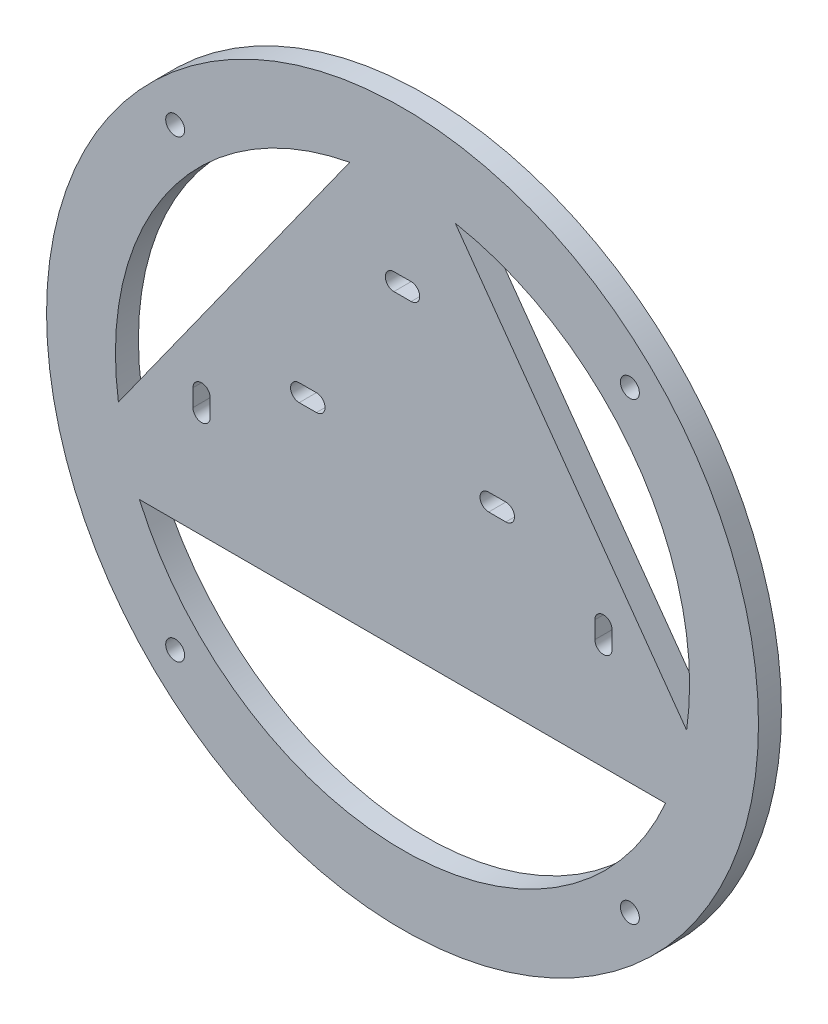
ISO-10303-21;
HEADER;
FILE_DESCRIPTION(('STEP AP214'),'2;1');
FILE_NAME('part.step','',(''),(''),'','','');
FILE_SCHEMA(('AUTOMOTIVE_DESIGN { 1 0 10303 214 1 1 1 1 }'));
ENDSEC;
DATA;
#1=APPLICATION_CONTEXT('core data for automotive mechanical design processes');
#2=APPLICATION_PROTOCOL_DEFINITION('international standard','automotive_design',2000,#1);
#3=PRODUCT_CONTEXT('',#1,'mechanical');
#4=PRODUCT('Part','Part','',(#3));
#5=PRODUCT_RELATED_PRODUCT_CATEGORY('part','',(#4));
#6=PRODUCT_DEFINITION_FORMATION('','',#4);
#7=PRODUCT_DEFINITION_CONTEXT('part definition',#1,'design');
#8=PRODUCT_DEFINITION('design','',#6,#7);
#9=PRODUCT_DEFINITION_SHAPE('','',#8);
#10=(LENGTH_UNIT() NAMED_UNIT(*) SI_UNIT(.MILLI.,.METRE.));
#11=(NAMED_UNIT(*) PLANE_ANGLE_UNIT() SI_UNIT($,.RADIAN.));
#12=(NAMED_UNIT(*) SI_UNIT($,.STERADIAN.) SOLID_ANGLE_UNIT());
#13=UNCERTAINTY_MEASURE_WITH_UNIT(LENGTH_MEASURE(1.E-05),#10,'distance_accuracy_value','');
#14=(GEOMETRIC_REPRESENTATION_CONTEXT(3) GLOBAL_UNCERTAINTY_ASSIGNED_CONTEXT((#13)) GLOBAL_UNIT_ASSIGNED_CONTEXT((#10,
#11,#12)) REPRESENTATION_CONTEXT('',''));
#15=CARTESIAN_POINT('',(0.,0.,0.));
#16=DIRECTION('',(0.,0.,1.));
#17=DIRECTION('',(1.,0.,0.));
#18=AXIS2_PLACEMENT_3D('',#15,#16,#17);
#19=CARTESIAN_POINT('',(-15.,10.,4.));
#20=DIRECTION('',(0.,0.,-1.));
#21=DIRECTION('',(-1.,0.,0.));
#22=AXIS2_PLACEMENT_3D('',#19,#20,#21);
#23=CYLINDRICAL_SURFACE('',#22,1.5);
#24=CARTESIAN_POINT('',(-15.,10.,0.));
#25=DIRECTION('',(0.,0.,1.));
#26=DIRECTION('',(1.,0.,0.));
#27=AXIS2_PLACEMENT_3D('',#24,#25,#26);
#28=CIRCLE('',#27,1.5);
#29=CARTESIAN_POINT('',(-15.,8.5,0.));
#30=VERTEX_POINT('',#29);
#31=CARTESIAN_POINT('',(-15.,11.5,0.));
#32=VERTEX_POINT('',#31);
#33=EDGE_CURVE('E352',#30,#32,#28,.T.);
#34=ORIENTED_EDGE('',*,*,#33,.F.);
#35=DIRECTION('',(0.,0.,-1.));
#36=VECTOR('',#35,1.);
#37=CARTESIAN_POINT('',(-15.,8.5,4.));
#38=LINE('',#37,#36);
#39=CARTESIAN_POINT('',(-15.,8.5,4.));
#40=VERTEX_POINT('',#39);
#41=EDGE_CURVE('E11',#40,#30,#38,.T.);
#42=ORIENTED_EDGE('',*,*,#41,.F.);
#43=CARTESIAN_POINT('',(-15.,10.,4.));
#44=DIRECTION('',(0.,0.,1.));
#45=DIRECTION('',(1.,0.,0.));
#46=AXIS2_PLACEMENT_3D('',#43,#44,#45);
#47=CIRCLE('',#46,1.5);
#48=CARTESIAN_POINT('',(-15.,11.5,4.));
#49=VERTEX_POINT('',#48);
#50=EDGE_CURVE('E246',#40,#49,#47,.T.);
#51=ORIENTED_EDGE('',*,*,#50,.T.);
#52=DIRECTION('',(0.,0.,-1.));
#53=VECTOR('',#52,1.);
#54=CARTESIAN_POINT('',(-15.,11.5,4.));
#55=LINE('',#54,#53);
#56=EDGE_CURVE('E155',#49,#32,#55,.T.);
#57=ORIENTED_EDGE('',*,*,#56,.T.);
#58=EDGE_LOOP('',(#34,#42,#51,#57));
#59=FACE_BOUND('',#58,.T.);
#60=ADVANCED_FACE('F47',(#59),#23,.F.);
#61=CARTESIAN_POINT('',(0.,8.5,4.));
#62=DIRECTION('',(0.,1.,0.));
#63=DIRECTION('',(0.,0.,1.));
#64=AXIS2_PLACEMENT_3D('',#61,#62,#63);
#65=PLANE('',#64);
#66=DIRECTION('',(1.,0.,0.));
#67=VECTOR('',#66,1.);
#68=CARTESIAN_POINT('',(0.,8.5,0.));
#69=LINE('',#68,#67);
#70=CARTESIAN_POINT('',(-18.,8.5,0.));
#71=VERTEX_POINT('',#70);
#72=EDGE_CURVE('E237',#71,#30,#69,.T.);
#73=ORIENTED_EDGE('',*,*,#72,.F.);
#74=DIRECTION('',(0.,0.,-1.));
#75=VECTOR('',#74,1.);
#76=CARTESIAN_POINT('',(-18.,8.5,4.));
#77=LINE('',#76,#75);
#78=CARTESIAN_POINT('',(-18.,8.5,4.));
#79=VERTEX_POINT('',#78);
#80=EDGE_CURVE('E58',#79,#71,#77,.T.);
#81=ORIENTED_EDGE('',*,*,#80,.F.);
#82=DIRECTION('',(1.,0.,0.));
#83=VECTOR('',#82,1.);
#84=CARTESIAN_POINT('',(0.,8.5,4.));
#85=LINE('',#84,#83);
#86=EDGE_CURVE('E235',#79,#40,#85,.T.);
#87=ORIENTED_EDGE('',*,*,#86,.T.);
#88=ORIENTED_EDGE('',*,*,#41,.T.);
#89=EDGE_LOOP('',(#73,#81,#87,#88));
#90=FACE_BOUND('',#89,.T.);
#91=ADVANCED_FACE('F234',(#90),#65,.T.);
#92=CARTESIAN_POINT('',(-18.,10.,4.));
#93=DIRECTION('',(0.,0.,-1.));
#94=DIRECTION('',(-1.,0.,0.));
#95=AXIS2_PLACEMENT_3D('',#92,#93,#94);
#96=CYLINDRICAL_SURFACE('',#95,1.5);
#97=CARTESIAN_POINT('',(-18.,10.,0.));
#98=DIRECTION('',(0.,0.,1.));
#99=DIRECTION('',(1.,0.,0.));
#100=AXIS2_PLACEMENT_3D('',#97,#98,#99);
#101=CIRCLE('',#100,1.5);
#102=CARTESIAN_POINT('',(-18.,11.5,0.));
#103=VERTEX_POINT('',#102);
#104=EDGE_CURVE('E358',#103,#71,#101,.T.);
#105=ORIENTED_EDGE('',*,*,#104,.F.);
#106=DIRECTION('',(0.,0.,-1.));
#107=VECTOR('',#106,1.);
#108=CARTESIAN_POINT('',(-18.,11.5,4.));
#109=LINE('',#108,#107);
#110=CARTESIAN_POINT('',(-18.,11.5,4.));
#111=VERTEX_POINT('',#110);
#112=EDGE_CURVE('E148',#111,#103,#109,.T.);
#113=ORIENTED_EDGE('',*,*,#112,.F.);
#114=CARTESIAN_POINT('',(-18.,10.,4.));
#115=DIRECTION('',(0.,0.,1.));
#116=DIRECTION('',(1.,0.,0.));
#117=AXIS2_PLACEMENT_3D('',#114,#115,#116);
#118=CIRCLE('',#117,1.5);
#119=EDGE_CURVE('E245',#111,#79,#118,.T.);
#120=ORIENTED_EDGE('',*,*,#119,.T.);
#121=ORIENTED_EDGE('',*,*,#80,.T.);
#122=EDGE_LOOP('',(#105,#113,#120,#121));
#123=FACE_BOUND('',#122,.T.);
#124=ADVANCED_FACE('F249',(#123),#96,.F.);
#125=CARTESIAN_POINT('',(-35.,1.50000000000038,4.));
#126=DIRECTION('',(0.,0.,-1.));
#127=DIRECTION('',(-1.,0.,0.));
#128=AXIS2_PLACEMENT_3D('',#125,#126,#127);
#129=CYLINDRICAL_SURFACE('',#128,1.5);
#130=CARTESIAN_POINT('',(-35.,1.50000000000038,0.));
#131=DIRECTION('',(0.,0.,1.));
#132=DIRECTION('',(1.,0.,0.));
#133=AXIS2_PLACEMENT_3D('',#130,#131,#132);
#134=CIRCLE('',#133,1.5);
#135=CARTESIAN_POINT('',(-33.5,1.50000000000036,0.));
#136=VERTEX_POINT('',#135);
#137=CARTESIAN_POINT('',(-36.5,1.50000000000039,0.));
#138=VERTEX_POINT('',#137);
#139=EDGE_CURVE('E336',#136,#138,#134,.T.);
#140=ORIENTED_EDGE('',*,*,#139,.F.);
#141=DIRECTION('',(0.,0.,-1.));
#142=VECTOR('',#141,1.);
#143=CARTESIAN_POINT('',(-33.5,1.50000000000036,4.));
#144=LINE('',#143,#142);
#145=CARTESIAN_POINT('',(-33.5,1.50000000000036,4.));
#146=VERTEX_POINT('',#145);
#147=EDGE_CURVE('E367',#146,#136,#144,.T.);
#148=ORIENTED_EDGE('',*,*,#147,.F.);
#149=CARTESIAN_POINT('',(-35.,1.50000000000038,4.));
#150=DIRECTION('',(0.,0.,1.));
#151=DIRECTION('',(1.,0.,0.));
#152=AXIS2_PLACEMENT_3D('',#149,#150,#151);
#153=CIRCLE('',#152,1.5);
#154=CARTESIAN_POINT('',(-36.5,1.50000000000039,4.));
#155=VERTEX_POINT('',#154);
#156=EDGE_CURVE('E513',#146,#155,#153,.T.);
#157=ORIENTED_EDGE('',*,*,#156,.T.);
#158=DIRECTION('',(0.,0.,-1.));
#159=VECTOR('',#158,1.);
#160=CARTESIAN_POINT('',(-36.5,1.50000000000039,4.));
#161=LINE('',#160,#159);
#162=EDGE_CURVE('E370',#155,#138,#161,.T.);
#163=ORIENTED_EDGE('',*,*,#162,.T.);
#164=EDGE_LOOP('',(#140,#148,#157,#163));
#165=FACE_BOUND('',#164,.T.);
#166=ADVANCED_FACE('F562',(#165),#129,.F.);
#167=CARTESIAN_POINT('',(-33.5,3.0993726104119E-13,4.));
#168=DIRECTION('',(-1.,0.,0.));
#169=DIRECTION('',(0.,-1.,0.));
#170=AXIS2_PLACEMENT_3D('',#167,#168,#169);
#171=PLANE('',#170);
#172=DIRECTION('',(0.,1.,0.));
#173=VECTOR('',#172,1.);
#174=CARTESIAN_POINT('',(-33.5,3.0993726104119E-13,0.));
#175=LINE('',#174,#173);
#176=CARTESIAN_POINT('',(-33.5,-1.49999999999964,0.));
#177=VERTEX_POINT('',#176);
#178=EDGE_CURVE('E340',#177,#136,#175,.T.);
#179=ORIENTED_EDGE('',*,*,#178,.F.);
#180=DIRECTION('',(0.,0.,-1.));
#181=VECTOR('',#180,1.);
#182=CARTESIAN_POINT('',(-33.5,-1.49999999999964,4.));
#183=LINE('',#182,#181);
#184=CARTESIAN_POINT('',(-33.5,-1.49999999999964,4.));
#185=VERTEX_POINT('',#184);
#186=EDGE_CURVE('E376',#185,#177,#183,.T.);
#187=ORIENTED_EDGE('',*,*,#186,.F.);
#188=DIRECTION('',(0.,1.,0.));
#189=VECTOR('',#188,1.);
#190=CARTESIAN_POINT('',(-33.5,3.0993726104119E-13,4.));
#191=LINE('',#190,#189);
#192=EDGE_CURVE('E517',#185,#146,#191,.T.);
#193=ORIENTED_EDGE('',*,*,#192,.T.);
#194=ORIENTED_EDGE('',*,*,#147,.T.);
#195=EDGE_LOOP('',(#179,#187,#193,#194));
#196=FACE_BOUND('',#195,.T.);
#197=ADVANCED_FACE('F558',(#196),#171,.T.);
#198=CARTESIAN_POINT('',(-35.,-1.49999999999962,4.));
#199=DIRECTION('',(0.,0.,-1.));
#200=DIRECTION('',(-1.,0.,0.));
#201=AXIS2_PLACEMENT_3D('',#198,#199,#200);
#202=CYLINDRICAL_SURFACE('',#201,1.5);
#203=CARTESIAN_POINT('',(-35.,-1.49999999999962,0.));
#204=DIRECTION('',(0.,0.,1.));
#205=DIRECTION('',(1.,0.,0.));
#206=AXIS2_PLACEMENT_3D('',#203,#204,#205);
#207=CIRCLE('',#206,1.5);
#208=CARTESIAN_POINT('',(-36.5,-1.49999999999961,0.));
#209=VERTEX_POINT('',#208);
#210=EDGE_CURVE('E344',#209,#177,#207,.T.);
#211=ORIENTED_EDGE('',*,*,#210,.F.);
#212=DIRECTION('',(0.,0.,-1.));
#213=VECTOR('',#212,1.);
#214=CARTESIAN_POINT('',(-36.5,-1.49999999999961,4.));
#215=LINE('',#214,#213);
#216=CARTESIAN_POINT('',(-36.5,-1.49999999999961,4.));
#217=VERTEX_POINT('',#216);
#218=EDGE_CURVE('E373',#217,#209,#215,.T.);
#219=ORIENTED_EDGE('',*,*,#218,.F.);
#220=CARTESIAN_POINT('',(-35.,-1.49999999999962,4.));
#221=DIRECTION('',(0.,0.,1.));
#222=DIRECTION('',(1.,0.,0.));
#223=AXIS2_PLACEMENT_3D('',#220,#221,#222);
#224=CIRCLE('',#223,1.5);
#225=EDGE_CURVE('E521',#217,#185,#224,.T.);
#226=ORIENTED_EDGE('',*,*,#225,.T.);
#227=ORIENTED_EDGE('',*,*,#186,.T.);
#228=EDGE_LOOP('',(#211,#219,#226,#227));
#229=FACE_BOUND('',#228,.T.);
#230=ADVANCED_FACE('F554',(#229),#202,.F.);
#231=CARTESIAN_POINT('',(0.,8.5,4.));
#232=DIRECTION('',(0.,-1.,0.));
#233=DIRECTION('',(0.,0.,-1.));
#234=AXIS2_PLACEMENT_3D('',#231,#232,#233);
#235=PLANE('',#234);
#236=DIRECTION('',(-1.,0.,0.));
#237=VECTOR('',#236,1.);
#238=CARTESIAN_POINT('',(0.,8.5,0.));
#239=LINE('',#238,#237);
#240=CARTESIAN_POINT('',(18.,8.5,0.));
#241=VERTEX_POINT('',#240);
#242=CARTESIAN_POINT('',(15.,8.5,0.));
#243=VERTEX_POINT('',#242);
#244=EDGE_CURVE('E321',#241,#243,#239,.T.);
#245=ORIENTED_EDGE('',*,*,#244,.T.);
#246=DIRECTION('',(0.,0.,-1.));
#247=VECTOR('',#246,1.);
#248=CARTESIAN_POINT('',(15.,8.5,4.));
#249=LINE('',#248,#247);
#250=CARTESIAN_POINT('',(15.,8.5,4.));
#251=VERTEX_POINT('',#250);
#252=EDGE_CURVE('E374',#251,#243,#249,.T.);
#253=ORIENTED_EDGE('',*,*,#252,.F.);
#254=DIRECTION('',(-1.,0.,0.));
#255=VECTOR('',#254,1.);
#256=CARTESIAN_POINT('',(0.,8.5,4.));
#257=LINE('',#256,#255);
#258=CARTESIAN_POINT('',(18.,8.5,4.));
#259=VERTEX_POINT('',#258);
#260=EDGE_CURVE('E500',#259,#251,#257,.T.);
#261=ORIENTED_EDGE('',*,*,#260,.F.);
#262=DIRECTION('',(0.,0.,-1.));
#263=VECTOR('',#262,1.);
#264=CARTESIAN_POINT('',(18.,8.5,4.));
#265=LINE('',#264,#263);
#266=EDGE_CURVE('E381',#259,#241,#265,.T.);
#267=ORIENTED_EDGE('',*,*,#266,.T.);
#268=EDGE_LOOP('',(#245,#253,#261,#267));
#269=FACE_BOUND('',#268,.T.);
#270=ADVANCED_FACE('F557',(#269),#235,.F.);
#271=CARTESIAN_POINT('',(15.,10.,4.));
#272=DIRECTION('',(0.,0.,-1.));
#273=DIRECTION('',(-1.,0.,0.));
#274=AXIS2_PLACEMENT_3D('',#271,#272,#273);
#275=CYLINDRICAL_SURFACE('',#274,1.5);
#276=CARTESIAN_POINT('',(15.,10.,0.));
#277=DIRECTION('',(0.,0.,1.));
#278=DIRECTION('',(1.,0.,0.));
#279=AXIS2_PLACEMENT_3D('',#276,#277,#278);
#280=CIRCLE('',#279,1.5);
#281=CARTESIAN_POINT('',(15.,11.5,0.));
#282=VERTEX_POINT('',#281);
#283=EDGE_CURVE('E325',#243,#282,#280,.F.);
#284=ORIENTED_EDGE('',*,*,#283,.T.);
#285=DIRECTION('',(0.,0.,-1.));
#286=VECTOR('',#285,1.);
#287=CARTESIAN_POINT('',(15.,11.5,4.));
#288=LINE('',#287,#286);
#289=CARTESIAN_POINT('',(15.,11.5,4.));
#290=VERTEX_POINT('',#289);
#291=EDGE_CURVE('E389',#290,#282,#288,.T.);
#292=ORIENTED_EDGE('',*,*,#291,.F.);
#293=CARTESIAN_POINT('',(15.,10.,4.));
#294=DIRECTION('',(0.,0.,1.));
#295=DIRECTION('',(1.,0.,0.));
#296=AXIS2_PLACEMENT_3D('',#293,#294,#295);
#297=CIRCLE('',#296,1.5);
#298=EDGE_CURVE('E504',#251,#290,#297,.F.);
#299=ORIENTED_EDGE('',*,*,#298,.F.);
#300=ORIENTED_EDGE('',*,*,#252,.T.);
#301=EDGE_LOOP('',(#284,#292,#299,#300));
#302=FACE_BOUND('',#301,.T.);
#303=ADVANCED_FACE('F575',(#302),#275,.F.);
#304=CARTESIAN_POINT('',(0.,11.5,4.));
#305=DIRECTION('',(0.,-1.,0.));
#306=DIRECTION('',(0.,0.,-1.));
#307=AXIS2_PLACEMENT_3D('',#304,#305,#306);
#308=PLANE('',#307);
#309=DIRECTION('',(-1.,0.,0.));
#310=VECTOR('',#309,1.);
#311=CARTESIAN_POINT('',(0.,11.5,0.));
#312=LINE('',#311,#310);
#313=CARTESIAN_POINT('',(18.,11.5,0.));
#314=VERTEX_POINT('',#313);
#315=EDGE_CURVE('E329',#314,#282,#312,.T.);
#316=ORIENTED_EDGE('',*,*,#315,.F.);
#317=DIRECTION('',(0.,0.,-1.));
#318=VECTOR('',#317,1.);
#319=CARTESIAN_POINT('',(18.,11.5,4.));
#320=LINE('',#319,#318);
#321=CARTESIAN_POINT('',(18.,11.5,4.));
#322=VERTEX_POINT('',#321);
#323=EDGE_CURVE('E385',#322,#314,#320,.T.);
#324=ORIENTED_EDGE('',*,*,#323,.F.);
#325=DIRECTION('',(-1.,0.,0.));
#326=VECTOR('',#325,1.);
#327=CARTESIAN_POINT('',(0.,11.5,4.));
#328=LINE('',#327,#326);
#329=EDGE_CURVE('E507',#322,#290,#328,.T.);
#330=ORIENTED_EDGE('',*,*,#329,.T.);
#331=ORIENTED_EDGE('',*,*,#291,.T.);
#332=EDGE_LOOP('',(#316,#324,#330,#331));
#333=FACE_BOUND('',#332,.T.);
#334=ADVANCED_FACE('F571',(#333),#308,.T.);
#335=CARTESIAN_POINT('',(35.,-1.50000000000014,4.));
#336=DIRECTION('',(0.,0.,-1.));
#337=DIRECTION('',(-1.,0.,0.));
#338=AXIS2_PLACEMENT_3D('',#335,#336,#337);
#339=CYLINDRICAL_SURFACE('',#338,1.5);
#340=CARTESIAN_POINT('',(35.,-1.50000000000014,0.));
#341=DIRECTION('',(0.,0.,1.));
#342=DIRECTION('',(1.,0.,0.));
#343=AXIS2_PLACEMENT_3D('',#340,#341,#342);
#344=CIRCLE('',#343,1.5);
#345=CARTESIAN_POINT('',(33.5,-1.50000000000013,0.));
#346=VERTEX_POINT('',#345);
#347=CARTESIAN_POINT('',(36.5,-1.50000000000014,0.));
#348=VERTEX_POINT('',#347);
#349=EDGE_CURVE('E305',#346,#348,#344,.T.);
#350=ORIENTED_EDGE('',*,*,#349,.F.);
#351=DIRECTION('',(0.,0.,-1.));
#352=VECTOR('',#351,1.);
#353=CARTESIAN_POINT('',(33.5,-1.50000000000013,4.));
#354=LINE('',#353,#352);
#355=CARTESIAN_POINT('',(33.5,-1.50000000000013,4.));
#356=VERTEX_POINT('',#355);
#357=EDGE_CURVE('E386',#356,#346,#354,.T.);
#358=ORIENTED_EDGE('',*,*,#357,.F.);
#359=CARTESIAN_POINT('',(35.,-1.50000000000014,4.));
#360=DIRECTION('',(0.,0.,1.));
#361=DIRECTION('',(1.,0.,0.));
#362=AXIS2_PLACEMENT_3D('',#359,#360,#361);
#363=CIRCLE('',#362,1.5);
#364=CARTESIAN_POINT('',(36.5,-1.50000000000014,4.));
#365=VERTEX_POINT('',#364);
#366=EDGE_CURVE('E485',#356,#365,#363,.T.);
#367=ORIENTED_EDGE('',*,*,#366,.T.);
#368=DIRECTION('',(0.,0.,-1.));
#369=VECTOR('',#368,1.);
#370=CARTESIAN_POINT('',(36.5,-1.50000000000014,4.));
#371=LINE('',#370,#369);
#372=EDGE_CURVE('E395',#365,#348,#371,.T.);
#373=ORIENTED_EDGE('',*,*,#372,.T.);
#374=EDGE_LOOP('',(#350,#358,#367,#373));
#375=FACE_BOUND('',#374,.T.);
#376=ADVANCED_FACE('F574',(#375),#339,.F.);
#377=CARTESIAN_POINT('',(33.5,-1.54968630520595E-13,4.));
#378=DIRECTION('',(1.,0.,0.));
#379=DIRECTION('',(0.,1.,0.));
#380=AXIS2_PLACEMENT_3D('',#377,#378,#379);
#381=PLANE('',#380);
#382=DIRECTION('',(0.,-1.,0.));
#383=VECTOR('',#382,1.);
#384=CARTESIAN_POINT('',(33.5,-1.54968630520595E-13,0.));
#385=LINE('',#384,#383);
#386=CARTESIAN_POINT('',(33.5,1.49999999999987,0.));
#387=VERTEX_POINT('',#386);
#388=EDGE_CURVE('E309',#387,#346,#385,.T.);
#389=ORIENTED_EDGE('',*,*,#388,.F.);
#390=DIRECTION('',(0.,0.,-1.));
#391=VECTOR('',#390,1.);
#392=CARTESIAN_POINT('',(33.5,1.49999999999987,4.));
#393=LINE('',#392,#391);
#394=CARTESIAN_POINT('',(33.5,1.49999999999987,4.));
#395=VERTEX_POINT('',#394);
#396=EDGE_CURVE('E402',#395,#387,#393,.T.);
#397=ORIENTED_EDGE('',*,*,#396,.F.);
#398=DIRECTION('',(0.,-1.,0.));
#399=VECTOR('',#398,1.);
#400=CARTESIAN_POINT('',(33.5,-1.54968630520595E-13,4.));
#401=LINE('',#400,#399);
#402=EDGE_CURVE('E489',#395,#356,#401,.T.);
#403=ORIENTED_EDGE('',*,*,#402,.T.);
#404=ORIENTED_EDGE('',*,*,#357,.T.);
#405=EDGE_LOOP('',(#389,#397,#403,#404));
#406=FACE_BOUND('',#405,.T.);
#407=ADVANCED_FACE('F591',(#406),#381,.T.);
#408=CARTESIAN_POINT('',(35.,1.49999999999986,4.));
#409=DIRECTION('',(0.,0.,-1.));
#410=DIRECTION('',(-1.,0.,0.));
#411=AXIS2_PLACEMENT_3D('',#408,#409,#410);
#412=CYLINDRICAL_SURFACE('',#411,1.5);
#413=CARTESIAN_POINT('',(35.,1.49999999999986,0.));
#414=DIRECTION('',(0.,0.,1.));
#415=DIRECTION('',(1.,0.,0.));
#416=AXIS2_PLACEMENT_3D('',#413,#414,#415);
#417=CIRCLE('',#416,1.5);
#418=CARTESIAN_POINT('',(36.5,1.49999999999986,0.));
#419=VERTEX_POINT('',#418);
#420=EDGE_CURVE('E313',#419,#387,#417,.T.);
#421=ORIENTED_EDGE('',*,*,#420,.F.);
#422=DIRECTION('',(0.,0.,-1.));
#423=VECTOR('',#422,1.);
#424=CARTESIAN_POINT('',(36.5,1.49999999999986,4.));
#425=LINE('',#424,#423);
#426=CARTESIAN_POINT('',(36.5,1.49999999999986,4.));
#427=VERTEX_POINT('',#426);
#428=EDGE_CURVE('E398',#427,#419,#425,.T.);
#429=ORIENTED_EDGE('',*,*,#428,.F.);
#430=CARTESIAN_POINT('',(35.,1.49999999999986,4.));
#431=DIRECTION('',(0.,0.,1.));
#432=DIRECTION('',(1.,0.,0.));
#433=AXIS2_PLACEMENT_3D('',#430,#431,#432);
#434=CIRCLE('',#433,1.5);
#435=EDGE_CURVE('E493',#427,#395,#434,.T.);
#436=ORIENTED_EDGE('',*,*,#435,.T.);
#437=ORIENTED_EDGE('',*,*,#396,.T.);
#438=EDGE_LOOP('',(#421,#429,#436,#437));
#439=FACE_BOUND('',#438,.T.);
#440=ADVANCED_FACE('F587',(#439),#412,.F.);
#441=CARTESIAN_POINT('',(0.,36.5,4.));
#442=DIRECTION('',(0.,1.,0.));
#443=DIRECTION('',(0.,0.,1.));
#444=AXIS2_PLACEMENT_3D('',#441,#442,#443);
#445=PLANE('',#444);
#446=DIRECTION('',(1.,0.,0.));
#447=VECTOR('',#446,1.);
#448=CARTESIAN_POINT('',(0.,36.5,0.));
#449=LINE('',#448,#447);
#450=CARTESIAN_POINT('',(-1.49999999999999,36.5,0.));
#451=VERTEX_POINT('',#450);
#452=CARTESIAN_POINT('',(1.50000000000001,36.5,0.));
#453=VERTEX_POINT('',#452);
#454=EDGE_CURVE('E289',#451,#453,#449,.T.);
#455=ORIENTED_EDGE('',*,*,#454,.T.);
#456=DIRECTION('',(0.,0.,-1.));
#457=VECTOR('',#456,1.);
#458=CARTESIAN_POINT('',(1.50000000000001,36.5,4.));
#459=LINE('',#458,#457);
#460=CARTESIAN_POINT('',(1.50000000000001,36.5,4.));
#461=VERTEX_POINT('',#460);
#462=EDGE_CURVE('E399',#461,#453,#459,.T.);
#463=ORIENTED_EDGE('',*,*,#462,.F.);
#464=DIRECTION('',(1.,0.,0.));
#465=VECTOR('',#464,1.);
#466=CARTESIAN_POINT('',(0.,36.5,4.));
#467=LINE('',#466,#465);
#468=CARTESIAN_POINT('',(-1.49999999999999,36.5,4.));
#469=VERTEX_POINT('',#468);
#470=EDGE_CURVE('E472',#469,#461,#467,.T.);
#471=ORIENTED_EDGE('',*,*,#470,.F.);
#472=DIRECTION('',(0.,0.,-1.));
#473=VECTOR('',#472,1.);
#474=CARTESIAN_POINT('',(-1.49999999999999,36.5,4.));
#475=LINE('',#474,#473);
#476=EDGE_CURVE('E407',#469,#451,#475,.T.);
#477=ORIENTED_EDGE('',*,*,#476,.T.);
#478=EDGE_LOOP('',(#455,#463,#471,#477));
#479=FACE_BOUND('',#478,.T.);
#480=ADVANCED_FACE('F590',(#479),#445,.F.);
#481=CARTESIAN_POINT('',(1.50000000000001,35.,4.));
#482=DIRECTION('',(0.,0.,-1.));
#483=DIRECTION('',(-1.,0.,0.));
#484=AXIS2_PLACEMENT_3D('',#481,#482,#483);
#485=CYLINDRICAL_SURFACE('',#484,1.5);
#486=CARTESIAN_POINT('',(1.50000000000001,35.,0.));
#487=DIRECTION('',(0.,0.,1.));
#488=DIRECTION('',(1.,0.,0.));
#489=AXIS2_PLACEMENT_3D('',#486,#487,#488);
#490=CIRCLE('',#489,1.5);
#491=CARTESIAN_POINT('',(1.50000000000001,33.5,0.));
#492=VERTEX_POINT('',#491);
#493=EDGE_CURVE('E293',#492,#453,#490,.T.);
#494=ORIENTED_EDGE('',*,*,#493,.F.);
#495=DIRECTION('',(0.,0.,-1.));
#496=VECTOR('',#495,1.);
#497=CARTESIAN_POINT('',(1.50000000000001,33.5,4.));
#498=LINE('',#497,#496);
#499=CARTESIAN_POINT('',(1.50000000000001,33.5,4.));
#500=VERTEX_POINT('',#499);
#501=EDGE_CURVE('E414',#500,#492,#498,.T.);
#502=ORIENTED_EDGE('',*,*,#501,.F.);
#503=CARTESIAN_POINT('',(1.50000000000001,35.,4.));
#504=DIRECTION('',(0.,0.,1.));
#505=DIRECTION('',(1.,0.,0.));
#506=AXIS2_PLACEMENT_3D('',#503,#504,#505);
#507=CIRCLE('',#506,1.5);
#508=EDGE_CURVE('E474',#500,#461,#507,.T.);
#509=ORIENTED_EDGE('',*,*,#508,.T.);
#510=ORIENTED_EDGE('',*,*,#462,.T.);
#511=EDGE_LOOP('',(#494,#502,#509,#510));
#512=FACE_BOUND('',#511,.T.);
#513=ADVANCED_FACE('F607',(#512),#485,.F.);
#514=CARTESIAN_POINT('',(0.,33.5,4.));
#515=DIRECTION('',(0.,1.,0.));
#516=DIRECTION('',(0.,0.,1.));
#517=AXIS2_PLACEMENT_3D('',#514,#515,#516);
#518=PLANE('',#517);
#519=DIRECTION('',(1.,0.,0.));
#520=VECTOR('',#519,1.);
#521=CARTESIAN_POINT('',(0.,33.5,0.));
#522=LINE('',#521,#520);
#523=CARTESIAN_POINT('',(-1.49999999999999,33.5,0.));
#524=VERTEX_POINT('',#523);
#525=EDGE_CURVE('E297',#524,#492,#522,.T.);
#526=ORIENTED_EDGE('',*,*,#525,.F.);
#527=DIRECTION('',(0.,0.,-1.));
#528=VECTOR('',#527,1.);
#529=CARTESIAN_POINT('',(-1.49999999999999,33.5,4.));
#530=LINE('',#529,#528);
#531=CARTESIAN_POINT('',(-1.49999999999999,33.5,4.));
#532=VERTEX_POINT('',#531);
#533=EDGE_CURVE('E410',#532,#524,#530,.T.);
#534=ORIENTED_EDGE('',*,*,#533,.F.);
#535=DIRECTION('',(1.,0.,0.));
#536=VECTOR('',#535,1.);
#537=CARTESIAN_POINT('',(0.,33.5,4.));
#538=LINE('',#537,#536);
#539=EDGE_CURVE('E478',#532,#500,#538,.T.);
#540=ORIENTED_EDGE('',*,*,#539,.T.);
#541=ORIENTED_EDGE('',*,*,#501,.T.);
#542=EDGE_LOOP('',(#526,#534,#540,#541));
#543=FACE_BOUND('',#542,.T.);
#544=ADVANCED_FACE('F603',(#543),#518,.T.);
#545=CARTESIAN_POINT('',(0.,0.,4.));
#546=DIRECTION('',(0.,0.,-1.));
#547=DIRECTION('',(-1.,0.,0.));
#548=AXIS2_PLACEMENT_3D('',#545,#546,#547);
#549=CYLINDRICAL_SURFACE('',#548,50.);
#550=CARTESIAN_POINT('',(0.,0.,0.));
#551=DIRECTION('',(0.,0.,1.));
#552=DIRECTION('',(1.,0.,0.));
#553=AXIS2_PLACEMENT_3D('',#550,#551,#552);
#554=CIRCLE('',#553,50.);
#555=CARTESIAN_POINT('',(-9.19485190031944,49.147275596224,0.));
#556=VERTEX_POINT('',#555);
#557=CARTESIAN_POINT('',(-49.4834168639443,-7.16878340230185,0.));
#558=VERTEX_POINT('',#557);
#559=EDGE_CURVE('E281',#556,#558,#554,.T.);
#560=ORIENTED_EDGE('',*,*,#559,.F.);
#561=DIRECTION('',(0.,0.,-1.));
#562=VECTOR('',#561,1.);
#563=CARTESIAN_POINT('',(-9.19485190031944,49.147275596224,4.));
#564=LINE('',#563,#562);
#565=CARTESIAN_POINT('',(-9.19485190031944,49.147275596224,4.));
#566=VERTEX_POINT('',#565);
#567=EDGE_CURVE('E411',#566,#556,#564,.T.);
#568=ORIENTED_EDGE('',*,*,#567,.F.);
#569=CARTESIAN_POINT('',(0.,0.,4.));
#570=DIRECTION('',(0.,0.,1.));
#571=DIRECTION('',(1.,0.,0.));
#572=AXIS2_PLACEMENT_3D('',#569,#570,#571);
#573=CIRCLE('',#572,50.);
#574=CARTESIAN_POINT('',(-49.4834168639443,-7.16878340230185,4.));
#575=VERTEX_POINT('',#574);
#576=EDGE_CURVE('E465',#566,#575,#573,.T.);
#577=ORIENTED_EDGE('',*,*,#576,.T.);
#578=DIRECTION('',(0.,0.,-1.));
#579=VECTOR('',#578,1.);
#580=CARTESIAN_POINT('',(-49.4834168639443,-7.16878340230185,4.));
#581=LINE('',#580,#579);
#582=EDGE_CURVE('E419',#575,#558,#581,.T.);
#583=ORIENTED_EDGE('',*,*,#582,.T.);
#584=EDGE_LOOP('',(#560,#568,#577,#583));
#585=FACE_BOUND('',#584,.T.);
#586=ADVANCED_FACE('F606',(#585),#549,.F.);
#587=CARTESIAN_POINT('',(29.3391343821318,20.9892460969611,4.));
#588=DIRECTION('',(-0.813304231287198,-0.581838660945059,0.));
#589=DIRECTION('',(0.581838660945059,-0.813304231287198,0.));
#590=AXIS2_PLACEMENT_3D('',#587,#588,#589);
#591=PLANE('',#590);
#592=DIRECTION('',(-0.581838660945059,0.813304231287198,0.));
#593=VECTOR('',#592,1.);
#594=CARTESIAN_POINT('',(29.3391343821318,20.9892460969611,0.));
#595=LINE('',#594,#593);
#596=CARTESIAN_POINT('',(49.4834168639442,-7.16878340230184,0.));
#597=VERTEX_POINT('',#596);
#598=CARTESIAN_POINT('',(9.19485190031945,49.147275596224,0.));
#599=VERTEX_POINT('',#598);
#600=EDGE_CURVE('E269',#597,#599,#595,.T.);
#601=ORIENTED_EDGE('',*,*,#600,.T.);
#602=DIRECTION('',(0.,0.,-1.));
#603=VECTOR('',#602,1.);
#604=CARTESIAN_POINT('',(9.19485190031945,49.147275596224,4.));
#605=LINE('',#604,#603);
#606=CARTESIAN_POINT('',(9.19485190031945,49.147275596224,4.));
#607=VERTEX_POINT('',#606);
#608=EDGE_CURVE('E422',#607,#599,#605,.T.);
#609=ORIENTED_EDGE('',*,*,#608,.F.);
#610=DIRECTION('',(-0.581838660945059,0.813304231287198,0.));
#611=VECTOR('',#610,1.);
#612=CARTESIAN_POINT('',(29.3391343821318,20.9892460969611,4.));
#613=LINE('',#612,#611);
#614=CARTESIAN_POINT('',(49.4834168639442,-7.16878340230184,4.));
#615=VERTEX_POINT('',#614);
#616=EDGE_CURVE('E450',#615,#607,#613,.T.);
#617=ORIENTED_EDGE('',*,*,#616,.F.);
#618=DIRECTION('',(0.,0.,-1.));
#619=VECTOR('',#618,1.);
#620=CARTESIAN_POINT('',(49.4834168639442,-7.16878340230184,4.));
#621=LINE('',#620,#619);
#622=EDGE_CURVE('E425',#615,#597,#621,.T.);
#623=ORIENTED_EDGE('',*,*,#622,.T.);
#624=EDGE_LOOP('',(#601,#609,#617,#623));
#625=FACE_BOUND('',#624,.T.);
#626=ADVANCED_FACE('F621',(#625),#591,.F.);
#627=CARTESIAN_POINT('',(0.,0.,4.));
#628=DIRECTION('',(0.,0.,-1.));
#629=DIRECTION('',(-1.,0.,0.));
#630=AXIS2_PLACEMENT_3D('',#627,#628,#629);
#631=CYLINDRICAL_SURFACE('',#630,50.);
#632=CARTESIAN_POINT('',(0.,0.,0.));
#633=DIRECTION('',(0.,0.,1.));
#634=DIRECTION('',(1.,0.,0.));
#635=AXIS2_PLACEMENT_3D('',#632,#633,#634);
#636=CIRCLE('',#635,50.);
#637=CARTESIAN_POINT('',(-45.8163641635951,-20.0215078060779,0.));
#638=VERTEX_POINT('',#637);
#639=CARTESIAN_POINT('',(45.8163641635951,-20.0215078060779,0.));
#640=VERTEX_POINT('',#639);
#641=EDGE_CURVE('E260',#638,#640,#636,.T.);
#642=ORIENTED_EDGE('',*,*,#641,.F.);
#643=DIRECTION('',(0.,0.,-1.));
#644=VECTOR('',#643,1.);
#645=CARTESIAN_POINT('',(-45.8163641635951,-20.0215078060779,4.));
#646=LINE('',#645,#644);
#647=CARTESIAN_POINT('',(-45.8163641635951,-20.0215078060779,4.));
#648=VERTEX_POINT('',#647);
#649=EDGE_CURVE('E162',#648,#638,#646,.T.);
#650=ORIENTED_EDGE('',*,*,#649,.F.);
#651=CARTESIAN_POINT('',(0.,0.,4.));
#652=DIRECTION('',(0.,0.,1.));
#653=DIRECTION('',(1.,0.,0.));
#654=AXIS2_PLACEMENT_3D('',#651,#652,#653);
#655=CIRCLE('',#654,50.);
#656=CARTESIAN_POINT('',(45.8163641635951,-20.0215078060779,4.));
#657=VERTEX_POINT('',#656);
#658=EDGE_CURVE('E364',#648,#657,#655,.T.);
#659=ORIENTED_EDGE('',*,*,#658,.T.);
#660=DIRECTION('',(0.,0.,-1.));
#661=VECTOR('',#660,1.);
#662=CARTESIAN_POINT('',(45.8163641635951,-20.0215078060779,4.));
#663=LINE('',#662,#661);
#664=EDGE_CURVE('E256',#657,#640,#663,.T.);
#665=ORIENTED_EDGE('',*,*,#664,.T.);
#666=EDGE_LOOP('',(#642,#650,#659,#665));
#667=FACE_BOUND('',#666,.T.);
#668=ADVANCED_FACE('F49',(#667),#631,.F.);
#669=CARTESIAN_POINT('',(-36.5,3.37692836656818E-13,4.));
#670=DIRECTION('',(-1.,0.,0.));
#671=DIRECTION('',(0.,-1.,0.));
#672=AXIS2_PLACEMENT_3D('',#669,#670,#671);
#673=PLANE('',#672);
#674=DIRECTION('',(0.,1.,0.));
#675=VECTOR('',#674,1.);
#676=CARTESIAN_POINT('',(-36.5,3.37692836656818E-13,0.));
#677=LINE('',#676,#675);
#678=EDGE_CURVE('E348',#209,#138,#677,.T.);
#679=ORIENTED_EDGE('',*,*,#678,.T.);
#680=ORIENTED_EDGE('',*,*,#162,.F.);
#681=DIRECTION('',(0.,1.,0.));
#682=VECTOR('',#681,1.);
#683=CARTESIAN_POINT('',(-36.5,3.37692836656818E-13,4.));
#684=LINE('',#683,#682);
#685=EDGE_CURVE('E525',#217,#155,#684,.T.);
#686=ORIENTED_EDGE('',*,*,#685,.F.);
#687=ORIENTED_EDGE('',*,*,#218,.T.);
#688=EDGE_LOOP('',(#679,#680,#686,#687));
#689=FACE_BOUND('',#688,.T.);
#690=ADVANCED_FACE('F549',(#689),#673,.F.);
#691=CARTESIAN_POINT('',(18.,10.,4.));
#692=DIRECTION('',(0.,0.,-1.));
#693=DIRECTION('',(-1.,0.,0.));
#694=AXIS2_PLACEMENT_3D('',#691,#692,#693);
#695=CYLINDRICAL_SURFACE('',#694,1.5);
#696=CARTESIAN_POINT('',(18.,10.,0.));
#697=DIRECTION('',(0.,0.,1.));
#698=DIRECTION('',(1.,0.,0.));
#699=AXIS2_PLACEMENT_3D('',#696,#697,#698);
#700=CIRCLE('',#699,1.5);
#701=EDGE_CURVE('E333',#314,#241,#700,.F.);
#702=ORIENTED_EDGE('',*,*,#701,.T.);
#703=ORIENTED_EDGE('',*,*,#266,.F.);
#704=CARTESIAN_POINT('',(18.,10.,4.));
#705=DIRECTION('',(0.,0.,1.));
#706=DIRECTION('',(1.,0.,0.));
#707=AXIS2_PLACEMENT_3D('',#704,#705,#706);
#708=CIRCLE('',#707,1.5);
#709=EDGE_CURVE('E511',#322,#259,#708,.F.);
#710=ORIENTED_EDGE('',*,*,#709,.F.);
#711=ORIENTED_EDGE('',*,*,#323,.T.);
#712=EDGE_LOOP('',(#702,#703,#710,#711));
#713=FACE_BOUND('',#712,.T.);
#714=ADVANCED_FACE('F552',(#713),#695,.F.);
#715=CARTESIAN_POINT('',(36.5,-1.68846418328409E-13,4.));
#716=DIRECTION('',(1.,0.,0.));
#717=DIRECTION('',(0.,1.,0.));
#718=AXIS2_PLACEMENT_3D('',#715,#716,#717);
#719=PLANE('',#718);
#720=DIRECTION('',(0.,-1.,0.));
#721=VECTOR('',#720,1.);
#722=CARTESIAN_POINT('',(36.5,-1.68846418328409E-13,0.));
#723=LINE('',#722,#721);
#724=EDGE_CURVE('E317',#419,#348,#723,.T.);
#725=ORIENTED_EDGE('',*,*,#724,.T.);
#726=ORIENTED_EDGE('',*,*,#372,.F.);
#727=DIRECTION('',(0.,-1.,0.));
#728=VECTOR('',#727,1.);
#729=CARTESIAN_POINT('',(36.5,-1.68846418328409E-13,4.));
#730=LINE('',#729,#728);
#731=EDGE_CURVE('E497',#427,#365,#730,.T.);
#732=ORIENTED_EDGE('',*,*,#731,.F.);
#733=ORIENTED_EDGE('',*,*,#428,.T.);
#734=EDGE_LOOP('',(#725,#726,#732,#733));
#735=FACE_BOUND('',#734,.T.);
#736=ADVANCED_FACE('F569',(#735),#719,.F.);
#737=CARTESIAN_POINT('',(-1.49999999999999,35.,4.));
#738=DIRECTION('',(0.,0.,-1.));
#739=DIRECTION('',(-1.,0.,0.));
#740=AXIS2_PLACEMENT_3D('',#737,#738,#739);
#741=CYLINDRICAL_SURFACE('',#740,1.5);
#742=CARTESIAN_POINT('',(-1.49999999999999,35.,0.));
#743=DIRECTION('',(0.,0.,1.));
#744=DIRECTION('',(1.,0.,0.));
#745=AXIS2_PLACEMENT_3D('',#742,#743,#744);
#746=CIRCLE('',#745,1.5);
#747=EDGE_CURVE('E301',#451,#524,#746,.T.);
#748=ORIENTED_EDGE('',*,*,#747,.F.);
#749=ORIENTED_EDGE('',*,*,#476,.F.);
#750=CARTESIAN_POINT('',(-1.49999999999999,35.,4.));
#751=DIRECTION('',(0.,0.,1.));
#752=DIRECTION('',(1.,0.,0.));
#753=AXIS2_PLACEMENT_3D('',#750,#751,#752);
#754=CIRCLE('',#753,1.5);
#755=EDGE_CURVE('E482',#469,#532,#754,.T.);
#756=ORIENTED_EDGE('',*,*,#755,.T.);
#757=ORIENTED_EDGE('',*,*,#533,.T.);
#758=EDGE_LOOP('',(#748,#749,#756,#757));
#759=FACE_BOUND('',#758,.T.);
#760=ADVANCED_FACE('F585',(#759),#741,.F.);
#761=CARTESIAN_POINT('',(-29.3391343821318,20.9892460969611,4.));
#762=DIRECTION('',(0.813304231287198,-0.581838660945059,0.));
#763=DIRECTION('',(0.581838660945059,0.813304231287198,0.));
#764=AXIS2_PLACEMENT_3D('',#761,#762,#763);
#765=PLANE('',#764);
#766=DIRECTION('',(-0.581838660945059,-0.813304231287198,0.));
#767=VECTOR('',#766,1.);
#768=CARTESIAN_POINT('',(-29.3391343821318,20.9892460969611,0.));
#769=LINE('',#768,#767);
#770=EDGE_CURVE('E285',#556,#558,#769,.T.);
#771=ORIENTED_EDGE('',*,*,#770,.T.);
#772=ORIENTED_EDGE('',*,*,#582,.F.);
#773=DIRECTION('',(-0.581838660945059,-0.813304231287198,0.));
#774=VECTOR('',#773,1.);
#775=CARTESIAN_POINT('',(-29.3391343821318,20.9892460969611,4.));
#776=LINE('',#775,#774);
#777=EDGE_CURVE('E469',#566,#575,#776,.T.);
#778=ORIENTED_EDGE('',*,*,#777,.F.);
#779=ORIENTED_EDGE('',*,*,#567,.T.);
#780=EDGE_LOOP('',(#771,#772,#778,#779));
#781=FACE_BOUND('',#780,.T.);
#782=ADVANCED_FACE('F601',(#781),#765,.F.);
#783=CARTESIAN_POINT('',(0.,0.,4.));
#784=DIRECTION('',(0.,0.,-1.));
#785=DIRECTION('',(-1.,0.,0.));
#786=AXIS2_PLACEMENT_3D('',#783,#784,#785);
#787=CYLINDRICAL_SURFACE('',#786,62.);
#788=CARTESIAN_POINT('',(0.,0.,4.));
#789=DIRECTION('',(0.,0.,1.));
#790=DIRECTION('',(1.,0.,0.));
#791=AXIS2_PLACEMENT_3D('',#788,#789,#790);
#792=CIRCLE('',#791,62.);
#793=CARTESIAN_POINT('',(62.,0.,4.));
#794=VERTEX_POINT('',#793);
#795=EDGE_CURVE('E461',#794,#794,#792,.T.);
#796=ORIENTED_EDGE('',*,*,#795,.F.);
#797=EDGE_LOOP('',(#796));
#798=FACE_BOUND('',#797,.T.);
#799=CARTESIAN_POINT('',(0.,0.,0.));
#800=DIRECTION('',(0.,0.,1.));
#801=DIRECTION('',(1.,0.,0.));
#802=AXIS2_PLACEMENT_3D('',#799,#800,#801);
#803=CIRCLE('',#802,62.);
#804=CARTESIAN_POINT('',(62.,0.,0.));
#805=VERTEX_POINT('',#804);
#806=EDGE_CURVE('E277',#805,#805,#803,.T.);
#807=ORIENTED_EDGE('',*,*,#806,.T.);
#808=EDGE_LOOP('',(#807));
#809=FACE_BOUND('',#808,.T.);
#810=ADVANCED_FACE('F617',(#798,#809),#787,.T.);
#811=CARTESIAN_POINT('',(0.,0.,4.));
#812=DIRECTION('',(0.,0.,-1.));
#813=DIRECTION('',(-1.,0.,0.));
#814=AXIS2_PLACEMENT_3D('',#811,#812,#813);
#815=CYLINDRICAL_SURFACE('',#814,50.);
#816=CARTESIAN_POINT('',(0.,0.,0.));
#817=DIRECTION('',(0.,0.,1.));
#818=DIRECTION('',(1.,0.,0.));
#819=AXIS2_PLACEMENT_3D('',#816,#817,#818);
#820=CIRCLE('',#819,50.);
#821=EDGE_CURVE('E273',#597,#599,#820,.T.);
#822=ORIENTED_EDGE('',*,*,#821,.F.);
#823=ORIENTED_EDGE('',*,*,#622,.F.);
#824=CARTESIAN_POINT('',(0.,0.,4.));
#825=DIRECTION('',(0.,0.,1.));
#826=DIRECTION('',(1.,0.,0.));
#827=AXIS2_PLACEMENT_3D('',#824,#825,#826);
#828=CIRCLE('',#827,50.);
#829=EDGE_CURVE('E457',#615,#607,#828,.T.);
#830=ORIENTED_EDGE('',*,*,#829,.T.);
#831=ORIENTED_EDGE('',*,*,#608,.T.);
#832=EDGE_LOOP('',(#822,#823,#830,#831));
#833=FACE_BOUND('',#832,.T.);
#834=ADVANCED_FACE('F539',(#833),#815,.F.);
#835=CARTESIAN_POINT('',(0.,-20.0215078060779,4.));
#836=DIRECTION('',(0.,1.,0.));
#837=DIRECTION('',(0.,0.,1.));
#838=AXIS2_PLACEMENT_3D('',#835,#836,#837);
#839=PLANE('',#838);
#840=DIRECTION('',(1.,0.,0.));
#841=VECTOR('',#840,1.);
#842=CARTESIAN_POINT('',(0.,-20.0215078060779,0.));
#843=LINE('',#842,#841);
#844=EDGE_CURVE('E264',#638,#640,#843,.T.);
#845=ORIENTED_EDGE('',*,*,#844,.T.);
#846=ORIENTED_EDGE('',*,*,#664,.F.);
#847=DIRECTION('',(1.,0.,0.));
#848=VECTOR('',#847,1.);
#849=CARTESIAN_POINT('',(0.,-20.0215078060779,4.));
#850=LINE('',#849,#848);
#851=EDGE_CURVE('E439',#648,#657,#850,.T.);
#852=ORIENTED_EDGE('',*,*,#851,.F.);
#853=ORIENTED_EDGE('',*,*,#649,.T.);
#854=EDGE_LOOP('',(#845,#846,#852,#853));
#855=FACE_BOUND('',#854,.T.);
#856=ADVANCED_FACE('F437',(#855),#839,.F.);
#857=CARTESIAN_POINT('',(0.,11.5,4.));
#858=DIRECTION('',(0.,1.,0.));
#859=DIRECTION('',(0.,0.,1.));
#860=AXIS2_PLACEMENT_3D('',#857,#858,#859);
#861=PLANE('',#860);
#862=DIRECTION('',(1.,0.,0.));
#863=VECTOR('',#862,1.);
#864=CARTESIAN_POINT('',(0.,11.5,0.));
#865=LINE('',#864,#863);
#866=EDGE_CURVE('E361',#103,#32,#865,.T.);
#867=ORIENTED_EDGE('',*,*,#866,.T.);
#868=ORIENTED_EDGE('',*,*,#56,.F.);
#869=DIRECTION('',(1.,0.,0.));
#870=VECTOR('',#869,1.);
#871=CARTESIAN_POINT('',(0.,11.5,4.));
#872=LINE('',#871,#870);
#873=EDGE_CURVE('E67',#111,#49,#872,.T.);
#874=ORIENTED_EDGE('',*,*,#873,.F.);
#875=ORIENTED_EDGE('',*,*,#112,.T.);
#876=EDGE_LOOP('',(#867,#868,#874,#875));
#877=FACE_BOUND('',#876,.T.);
#878=ADVANCED_FACE('F530',(#877),#861,.F.);
#879=CARTESIAN_POINT('',(0.,0.,4.));
#880=DIRECTION('',(0.,0.,1.));
#881=DIRECTION('',(1.,0.,0.));
#882=AXIS2_PLACEMENT_3D('',#879,#880,#881);
#883=PLANE('',#882);
#884=CARTESIAN_POINT('',(-39.5979797464469,39.5979797464465,4.));
#885=DIRECTION('',(0.,0.,1.));
#886=DIRECTION('',(1.,0.,0.));
#887=AXIS2_PLACEMENT_3D('',#884,#885,#886);
#888=CIRCLE('',#887,1.64999999999999);
#889=CARTESIAN_POINT('',(-37.9479797464469,39.5979797464465,4.));
#890=VERTEX_POINT('',#889);
#891=EDGE_CURVE('E694',#890,#890,#888,.T.);
#892=ORIENTED_EDGE('',*,*,#891,.F.);
#893=EDGE_LOOP('',(#892));
#894=FACE_BOUND('',#893,.T.);
#895=CARTESIAN_POINT('',(-39.5979797464463,-39.597979746447,4.));
#896=DIRECTION('',(0.,0.,1.));
#897=DIRECTION('',(1.,0.,0.));
#898=AXIS2_PLACEMENT_3D('',#895,#896,#897);
#899=CIRCLE('',#898,1.64999999999999);
#900=CARTESIAN_POINT('',(-37.9479797464463,-39.597979746447,4.));
#901=VERTEX_POINT('',#900);
#902=EDGE_CURVE('E698',#901,#901,#899,.T.);
#903=ORIENTED_EDGE('',*,*,#902,.F.);
#904=EDGE_LOOP('',(#903));
#905=FACE_BOUND('',#904,.T.);
#906=CARTESIAN_POINT('',(39.5979797464467,-39.5979797464466,4.));
#907=DIRECTION('',(0.,0.,1.));
#908=DIRECTION('',(1.,0.,0.));
#909=AXIS2_PLACEMENT_3D('',#906,#907,#908);
#910=CIRCLE('',#909,1.64999999999999);
#911=CARTESIAN_POINT('',(41.2479797464467,-39.5979797464466,4.));
#912=VERTEX_POINT('',#911);
#913=EDGE_CURVE('E706',#912,#912,#910,.T.);
#914=ORIENTED_EDGE('',*,*,#913,.F.);
#915=EDGE_LOOP('',(#914));
#916=FACE_BOUND('',#915,.T.);
#917=CARTESIAN_POINT('',(39.5979797464466,39.5979797464467,4.));
#918=DIRECTION('',(0.,0.,1.));
#919=DIRECTION('',(1.,0.,0.));
#920=AXIS2_PLACEMENT_3D('',#917,#918,#919);
#921=CIRCLE('',#920,1.64999999999999);
#922=CARTESIAN_POINT('',(41.2479797464466,39.5979797464467,4.));
#923=VERTEX_POINT('',#922);
#924=EDGE_CURVE('E713',#923,#923,#921,.T.);
#925=ORIENTED_EDGE('',*,*,#924,.F.);
#926=EDGE_LOOP('',(#925));
#927=FACE_BOUND('',#926,.T.);
#928=ORIENTED_EDGE('',*,*,#658,.F.);
#929=ORIENTED_EDGE('',*,*,#851,.T.);
#930=EDGE_LOOP('',(#928,#929));
#931=FACE_BOUND('',#930,.T.);
#932=ORIENTED_EDGE('',*,*,#616,.T.);
#933=ORIENTED_EDGE('',*,*,#829,.F.);
#934=EDGE_LOOP('',(#932,#933));
#935=FACE_BOUND('',#934,.T.);
#936=ORIENTED_EDGE('',*,*,#795,.T.);
#937=EDGE_LOOP('',(#936));
#938=FACE_BOUND('',#937,.T.);
#939=ORIENTED_EDGE('',*,*,#576,.F.);
#940=ORIENTED_EDGE('',*,*,#777,.T.);
#941=EDGE_LOOP('',(#939,#940));
#942=FACE_BOUND('',#941,.T.);
#943=ORIENTED_EDGE('',*,*,#470,.T.);
#944=ORIENTED_EDGE('',*,*,#508,.F.);
#945=ORIENTED_EDGE('',*,*,#539,.F.);
#946=ORIENTED_EDGE('',*,*,#755,.F.);
#947=EDGE_LOOP('',(#943,#944,#945,#946));
#948=FACE_BOUND('',#947,.T.);
#949=ORIENTED_EDGE('',*,*,#366,.F.);
#950=ORIENTED_EDGE('',*,*,#402,.F.);
#951=ORIENTED_EDGE('',*,*,#435,.F.);
#952=ORIENTED_EDGE('',*,*,#731,.T.);
#953=EDGE_LOOP('',(#949,#950,#951,#952));
#954=FACE_BOUND('',#953,.T.);
#955=ORIENTED_EDGE('',*,*,#260,.T.);
#956=ORIENTED_EDGE('',*,*,#298,.T.);
#957=ORIENTED_EDGE('',*,*,#329,.F.);
#958=ORIENTED_EDGE('',*,*,#709,.T.);
#959=EDGE_LOOP('',(#955,#956,#957,#958));
#960=FACE_BOUND('',#959,.T.);
#961=ORIENTED_EDGE('',*,*,#156,.F.);
#962=ORIENTED_EDGE('',*,*,#192,.F.);
#963=ORIENTED_EDGE('',*,*,#225,.F.);
#964=ORIENTED_EDGE('',*,*,#685,.T.);
#965=EDGE_LOOP('',(#961,#962,#963,#964));
#966=FACE_BOUND('',#965,.T.);
#967=ORIENTED_EDGE('',*,*,#50,.F.);
#968=ORIENTED_EDGE('',*,*,#86,.F.);
#969=ORIENTED_EDGE('',*,*,#119,.F.);
#970=ORIENTED_EDGE('',*,*,#873,.T.);
#971=EDGE_LOOP('',(#967,#968,#969,#970));
#972=FACE_BOUND('',#971,.T.);
#973=ADVANCED_FACE('F244',(#894,#905,#916,#927,#931,#935,#938,#942,#948,#954,#960,#966,#972),
#883,.T.);
#974=CARTESIAN_POINT('',(0.,0.,0.));
#975=DIRECTION('',(0.,0.,1.));
#976=DIRECTION('',(1.,0.,0.));
#977=AXIS2_PLACEMENT_3D('',#974,#975,#976);
#978=PLANE('',#977);
#979=CARTESIAN_POINT('',(-39.5979797464469,39.5979797464465,0.));
#980=DIRECTION('',(0.,0.,1.));
#981=DIRECTION('',(1.,0.,0.));
#982=AXIS2_PLACEMENT_3D('',#979,#980,#981);
#983=CIRCLE('',#982,1.64999999999999);
#984=CARTESIAN_POINT('',(-37.9479797464469,39.5979797464465,0.));
#985=VERTEX_POINT('',#984);
#986=EDGE_CURVE('E696',#985,#985,#983,.T.);
#987=ORIENTED_EDGE('',*,*,#986,.T.);
#988=EDGE_LOOP('',(#987));
#989=FACE_BOUND('',#988,.T.);
#990=CARTESIAN_POINT('',(-39.5979797464463,-39.597979746447,0.));
#991=DIRECTION('',(0.,0.,1.));
#992=DIRECTION('',(1.,0.,0.));
#993=AXIS2_PLACEMENT_3D('',#990,#991,#992);
#994=CIRCLE('',#993,1.64999999999999);
#995=CARTESIAN_POINT('',(-37.9479797464463,-39.597979746447,0.));
#996=VERTEX_POINT('',#995);
#997=EDGE_CURVE('E51',#996,#996,#994,.T.);
#998=ORIENTED_EDGE('',*,*,#997,.T.);
#999=EDGE_LOOP('',(#998));
#1000=FACE_BOUND('',#999,.T.);
#1001=CARTESIAN_POINT('',(39.5979797464467,-39.5979797464466,0.));
#1002=DIRECTION('',(0.,0.,1.));
#1003=DIRECTION('',(1.,0.,0.));
#1004=AXIS2_PLACEMENT_3D('',#1001,#1002,#1003);
#1005=CIRCLE('',#1004,1.64999999999999);
#1006=CARTESIAN_POINT('',(41.2479797464467,-39.5979797464466,0.));
#1007=VERTEX_POINT('',#1006);
#1008=EDGE_CURVE('E710',#1007,#1007,#1005,.T.);
#1009=ORIENTED_EDGE('',*,*,#1008,.T.);
#1010=EDGE_LOOP('',(#1009));
#1011=FACE_BOUND('',#1010,.T.);
#1012=CARTESIAN_POINT('',(39.5979797464466,39.5979797464467,0.));
#1013=DIRECTION('',(0.,0.,1.));
#1014=DIRECTION('',(1.,0.,0.));
#1015=AXIS2_PLACEMENT_3D('',#1012,#1013,#1014);
#1016=CIRCLE('',#1015,1.64999999999999);
#1017=CARTESIAN_POINT('',(41.2479797464466,39.5979797464467,0.));
#1018=VERTEX_POINT('',#1017);
#1019=EDGE_CURVE('E265',#1018,#1018,#1016,.T.);
#1020=ORIENTED_EDGE('',*,*,#1019,.T.);
#1021=EDGE_LOOP('',(#1020));
#1022=FACE_BOUND('',#1021,.T.);
#1023=ORIENTED_EDGE('',*,*,#641,.T.);
#1024=ORIENTED_EDGE('',*,*,#844,.F.);
#1025=EDGE_LOOP('',(#1023,#1024));
#1026=FACE_BOUND('',#1025,.T.);
#1027=ORIENTED_EDGE('',*,*,#600,.F.);
#1028=ORIENTED_EDGE('',*,*,#821,.T.);
#1029=EDGE_LOOP('',(#1027,#1028));
#1030=FACE_BOUND('',#1029,.T.);
#1031=ORIENTED_EDGE('',*,*,#806,.F.);
#1032=EDGE_LOOP('',(#1031));
#1033=FACE_BOUND('',#1032,.T.);
#1034=ORIENTED_EDGE('',*,*,#559,.T.);
#1035=ORIENTED_EDGE('',*,*,#770,.F.);
#1036=EDGE_LOOP('',(#1034,#1035));
#1037=FACE_BOUND('',#1036,.T.);
#1038=ORIENTED_EDGE('',*,*,#454,.F.);
#1039=ORIENTED_EDGE('',*,*,#747,.T.);
#1040=ORIENTED_EDGE('',*,*,#525,.T.);
#1041=ORIENTED_EDGE('',*,*,#493,.T.);
#1042=EDGE_LOOP('',(#1038,#1039,#1040,#1041));
#1043=FACE_BOUND('',#1042,.T.);
#1044=ORIENTED_EDGE('',*,*,#349,.T.);
#1045=ORIENTED_EDGE('',*,*,#724,.F.);
#1046=ORIENTED_EDGE('',*,*,#420,.T.);
#1047=ORIENTED_EDGE('',*,*,#388,.T.);
#1048=EDGE_LOOP('',(#1044,#1045,#1046,#1047));
#1049=FACE_BOUND('',#1048,.T.);
#1050=ORIENTED_EDGE('',*,*,#244,.F.);
#1051=ORIENTED_EDGE('',*,*,#701,.F.);
#1052=ORIENTED_EDGE('',*,*,#315,.T.);
#1053=ORIENTED_EDGE('',*,*,#283,.F.);
#1054=EDGE_LOOP('',(#1050,#1051,#1052,#1053));
#1055=FACE_BOUND('',#1054,.T.);
#1056=ORIENTED_EDGE('',*,*,#139,.T.);
#1057=ORIENTED_EDGE('',*,*,#678,.F.);
#1058=ORIENTED_EDGE('',*,*,#210,.T.);
#1059=ORIENTED_EDGE('',*,*,#178,.T.);
#1060=EDGE_LOOP('',(#1056,#1057,#1058,#1059));
#1061=FACE_BOUND('',#1060,.T.);
#1062=ORIENTED_EDGE('',*,*,#33,.T.);
#1063=ORIENTED_EDGE('',*,*,#866,.F.);
#1064=ORIENTED_EDGE('',*,*,#104,.T.);
#1065=ORIENTED_EDGE('',*,*,#72,.T.);
#1066=EDGE_LOOP('',(#1062,#1063,#1064,#1065));
#1067=FACE_BOUND('',#1066,.T.);
#1068=ADVANCED_FACE('F442',(#989,#1000,#1011,#1022,#1026,#1030,#1033,#1037,#1043,#1049,#1055,
#1061,#1067),#978,.F.);
#1069=CARTESIAN_POINT('',(39.5979797464466,39.5979797464467,4.));
#1070=DIRECTION('',(0.,0.,1.));
#1071=DIRECTION('',(1.,0.,0.));
#1072=AXIS2_PLACEMENT_3D('',#1069,#1070,#1071);
#1073=CYLINDRICAL_SURFACE('',#1072,1.64999999999999);
#1074=ORIENTED_EDGE('',*,*,#924,.T.);
#1075=EDGE_LOOP('',(#1074));
#1076=FACE_BOUND('',#1075,.T.);
#1077=ORIENTED_EDGE('',*,*,#1019,.F.);
#1078=EDGE_LOOP('',(#1077));
#1079=FACE_BOUND('',#1078,.T.);
#1080=ADVANCED_FACE('F668',(#1076,#1079),#1073,.F.);
#1081=CARTESIAN_POINT('',(39.5979797464467,-39.5979797464466,4.));
#1082=DIRECTION('',(0.,0.,1.));
#1083=DIRECTION('',(1.,0.,0.));
#1084=AXIS2_PLACEMENT_3D('',#1081,#1082,#1083);
#1085=CYLINDRICAL_SURFACE('',#1084,1.64999999999999);
#1086=ORIENTED_EDGE('',*,*,#913,.T.);
#1087=EDGE_LOOP('',(#1086));
#1088=FACE_BOUND('',#1087,.T.);
#1089=ORIENTED_EDGE('',*,*,#1008,.F.);
#1090=EDGE_LOOP('',(#1089));
#1091=FACE_BOUND('',#1090,.T.);
#1092=ADVANCED_FACE('F673',(#1088,#1091),#1085,.F.);
#1093=CARTESIAN_POINT('',(-39.5979797464463,-39.597979746447,4.));
#1094=DIRECTION('',(0.,0.,1.));
#1095=DIRECTION('',(1.,0.,0.));
#1096=AXIS2_PLACEMENT_3D('',#1093,#1094,#1095);
#1097=CYLINDRICAL_SURFACE('',#1096,1.64999999999999);
#1098=ORIENTED_EDGE('',*,*,#902,.T.);
#1099=EDGE_LOOP('',(#1098));
#1100=FACE_BOUND('',#1099,.T.);
#1101=ORIENTED_EDGE('',*,*,#997,.F.);
#1102=EDGE_LOOP('',(#1101));
#1103=FACE_BOUND('',#1102,.T.);
#1104=ADVANCED_FACE('F681',(#1100,#1103),#1097,.F.);
#1105=CARTESIAN_POINT('',(-39.5979797464469,39.5979797464465,4.));
#1106=DIRECTION('',(0.,0.,1.));
#1107=DIRECTION('',(1.,0.,0.));
#1108=AXIS2_PLACEMENT_3D('',#1105,#1106,#1107);
#1109=CYLINDRICAL_SURFACE('',#1108,1.64999999999999);
#1110=ORIENTED_EDGE('',*,*,#891,.T.);
#1111=EDGE_LOOP('',(#1110));
#1112=FACE_BOUND('',#1111,.T.);
#1113=ORIENTED_EDGE('',*,*,#986,.F.);
#1114=EDGE_LOOP('',(#1113));
#1115=FACE_BOUND('',#1114,.T.);
#1116=ADVANCED_FACE('F685',(#1112,#1115),#1109,.F.);
#1117=CLOSED_SHELL('',(#60,#91,#124,#166,#197,#230,#270,#303,#334,#376,#407,#440,#480,#513,#544,
#586,#626,#668,#690,#714,#736,#760,#782,#810,#834,#856,#878,#973,#1068,#1080,#1092,#1104,#1116));
#1118=MANIFOLD_SOLID_BREP('B2',#1117);
#1119=ADVANCED_BREP_SHAPE_REPRESENTATION('',(#18,#1118),#14);
#1120=SHAPE_DEFINITION_REPRESENTATION(#9,#1119);
ENDSEC;
END-ISO-10303-21;
